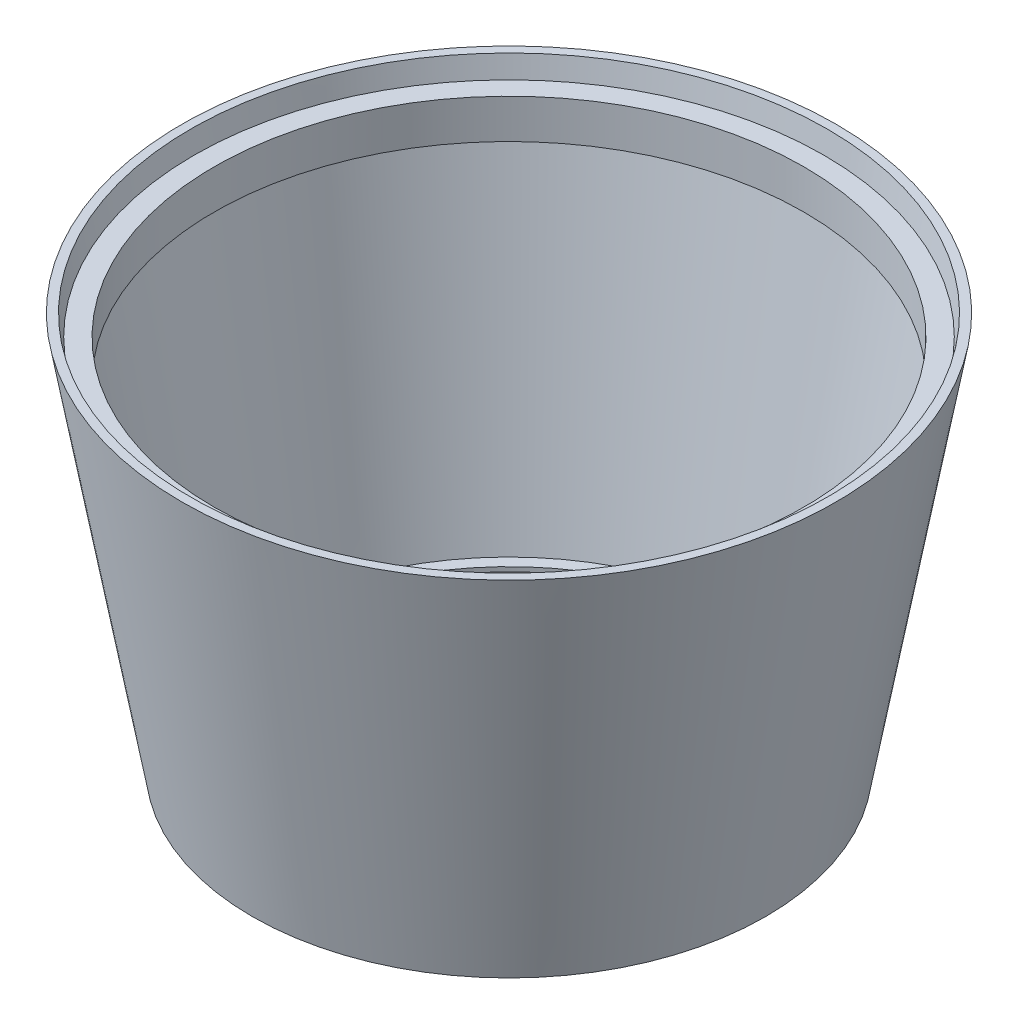
ISO-10303-21;
HEADER;
FILE_DESCRIPTION(('STEP AP214'),'2;1');
FILE_NAME('part.step','',(''),(''),'','','');
FILE_SCHEMA(('AUTOMOTIVE_DESIGN { 1 0 10303 214 1 1 1 1 }'));
ENDSEC;
DATA;
#1=APPLICATION_CONTEXT('core data for automotive mechanical design processes');
#2=APPLICATION_PROTOCOL_DEFINITION('international standard','automotive_design',2000,#1);
#3=PRODUCT_CONTEXT('',#1,'mechanical');
#4=PRODUCT('Part','Part','',(#3));
#5=PRODUCT_RELATED_PRODUCT_CATEGORY('part','',(#4));
#6=PRODUCT_DEFINITION_FORMATION('','',#4);
#7=PRODUCT_DEFINITION_CONTEXT('part definition',#1,'design');
#8=PRODUCT_DEFINITION('design','',#6,#7);
#9=PRODUCT_DEFINITION_SHAPE('','',#8);
#10=(LENGTH_UNIT() NAMED_UNIT(*) SI_UNIT(.MILLI.,.METRE.));
#11=(NAMED_UNIT(*) PLANE_ANGLE_UNIT() SI_UNIT($,.RADIAN.));
#12=(NAMED_UNIT(*) SI_UNIT($,.STERADIAN.) SOLID_ANGLE_UNIT());
#13=UNCERTAINTY_MEASURE_WITH_UNIT(LENGTH_MEASURE(1.E-05),#10,'distance_accuracy_value','');
#14=(GEOMETRIC_REPRESENTATION_CONTEXT(3) GLOBAL_UNCERTAINTY_ASSIGNED_CONTEXT((#13)) GLOBAL_UNIT_ASSIGNED_CONTEXT((#10,
#11,#12)) REPRESENTATION_CONTEXT('',''));
#15=CARTESIAN_POINT('',(0.,0.,0.));
#16=DIRECTION('',(0.,0.,1.));
#17=DIRECTION('',(1.,0.,0.));
#18=AXIS2_PLACEMENT_3D('',#15,#16,#17);
#19=CARTESIAN_POINT('',(-752.,0.,0.));
#20=DIRECTION('',(0.,-1.,0.));
#21=DIRECTION('',(0.,0.,-1.));
#22=AXIS2_PLACEMENT_3D('',#19,#20,#21);
#23=CYLINDRICAL_SURFACE('',#22,752.);
#24=CARTESIAN_POINT('',(-752.,0.,0.));
#25=DIRECTION('',(0.,-1.,0.));
#26=DIRECTION('',(0.,0.,-1.));
#27=AXIS2_PLACEMENT_3D('',#24,#25,#26);
#28=CIRCLE('',#27,752.);
#29=CARTESIAN_POINT('',(-752.,0.,-752.));
#30=VERTEX_POINT('',#29);
#31=EDGE_CURVE('E69',#30,#30,#28,.T.);
#32=ORIENTED_EDGE('',*,*,#31,.T.);
#33=EDGE_LOOP('',(#32));
#34=FACE_BOUND('',#33,.T.);
#35=CARTESIAN_POINT('',(-752.,14.,0.));
#36=DIRECTION('',(0.,-1.,0.));
#37=DIRECTION('',(0.,0.,-1.));
#38=AXIS2_PLACEMENT_3D('',#35,#36,#37);
#39=CIRCLE('',#38,752.);
#40=CARTESIAN_POINT('',(-752.,14.,-752.));
#41=VERTEX_POINT('',#40);
#42=EDGE_CURVE('E10',#41,#41,#39,.T.);
#43=ORIENTED_EDGE('',*,*,#42,.F.);
#44=EDGE_LOOP('',(#43));
#45=FACE_BOUND('',#44,.T.);
#46=ADVANCED_FACE('F35',(#34,#45),#23,.F.);
#47=CARTESIAN_POINT('',(0.,14.,0.));
#48=DIRECTION('',(0.,1.,0.));
#49=DIRECTION('',(0.,0.,1.));
#50=AXIS2_PLACEMENT_3D('',#47,#48,#49);
#51=PLANE('',#50);
#52=ORIENTED_EDGE('',*,*,#42,.T.);
#53=EDGE_LOOP('',(#52));
#54=FACE_BOUND('',#53,.T.);
#55=CARTESIAN_POINT('',(-752.,14.0000000000001,0.));
#56=DIRECTION('',(0.,-1.,0.));
#57=DIRECTION('',(0.,0.,-1.));
#58=AXIS2_PLACEMENT_3D('',#55,#56,#57);
#59=CIRCLE('',#58,788.718983852641);
#60=CARTESIAN_POINT('',(-752.,14.0000000000001,-788.718983852641));
#61=VERTEX_POINT('',#60);
#62=EDGE_CURVE('E41',#61,#61,#59,.T.);
#63=ORIENTED_EDGE('',*,*,#62,.F.);
#64=EDGE_LOOP('',(#63));
#65=FACE_BOUND('',#64,.T.);
#66=ADVANCED_FACE('F87',(#54,#65),#51,.T.);
#67=CARTESIAN_POINT('',(-752.,1044.49266555275,0.));
#68=DIRECTION('',(0.,1.,0.));
#69=DIRECTION('',(0.,0.,1.));
#70=AXIS2_PLACEMENT_3D('',#67,#68,#69);
#71=CONICAL_SURFACE('',#70,972.729405102118,0.176703094880363);
#72=ORIENTED_EDGE('',*,*,#62,.T.);
#73=EDGE_LOOP('',(#72));
#74=FACE_BOUND('',#73,.T.);
#75=CARTESIAN_POINT('',(-752.,1044.49266555275,0.));
#76=DIRECTION('',(0.,-1.,0.));
#77=DIRECTION('',(0.,0.,-1.));
#78=AXIS2_PLACEMENT_3D('',#75,#76,#77);
#79=CIRCLE('',#78,972.729405102118);
#80=CARTESIAN_POINT('',(-752.,1044.49266555275,-972.729405102118));
#81=VERTEX_POINT('',#80);
#82=EDGE_CURVE('E45',#81,#81,#79,.T.);
#83=ORIENTED_EDGE('',*,*,#82,.F.);
#84=EDGE_LOOP('',(#83));
#85=FACE_BOUND('',#84,.T.);
#86=ADVANCED_FACE('F91',(#74,#85),#71,.F.);
#87=CARTESIAN_POINT('',(169.04405635691,1044.49266555275,0.));
#88=DIRECTION('',(0.,-1.,0.));
#89=DIRECTION('',(0.,0.,-1.));
#90=AXIS2_PLACEMENT_3D('',#87,#88,#89);
#91=PLANE('',#90);
#92=ORIENTED_EDGE('',*,*,#82,.T.);
#93=EDGE_LOOP('',(#92));
#94=FACE_BOUND('',#93,.T.);
#95=CARTESIAN_POINT('',(-752.,1044.49266555275,0.));
#96=DIRECTION('',(0.,-1.,0.));
#97=DIRECTION('',(0.,0.,-1.));
#98=AXIS2_PLACEMENT_3D('',#95,#96,#97);
#99=CIRCLE('',#98,921.04405635691);
#100=CARTESIAN_POINT('',(-752.,1044.49266555275,-921.04405635691));
#101=VERTEX_POINT('',#100);
#102=EDGE_CURVE('E49',#101,#101,#99,.T.);
#103=ORIENTED_EDGE('',*,*,#102,.F.);
#104=EDGE_LOOP('',(#103));
#105=FACE_BOUND('',#104,.T.);
#106=ADVANCED_FACE('F95',(#94,#105),#91,.T.);
#107=CARTESIAN_POINT('',(-752.,0.,0.));
#108=DIRECTION('',(0.,-1.,0.));
#109=DIRECTION('',(0.,0.,-1.));
#110=AXIS2_PLACEMENT_3D('',#107,#108,#109);
#111=CYLINDRICAL_SURFACE('',#110,921.04405635691);
#112=ORIENTED_EDGE('',*,*,#102,.T.);
#113=EDGE_LOOP('',(#112));
#114=FACE_BOUND('',#113,.T.);
#115=CARTESIAN_POINT('',(-752.,1167.02375388334,0.));
#116=DIRECTION('',(0.,-1.,0.));
#117=DIRECTION('',(0.,0.,-1.));
#118=AXIS2_PLACEMENT_3D('',#115,#116,#117);
#119=CIRCLE('',#118,921.04405635691);
#120=CARTESIAN_POINT('',(-752.,1167.02375388334,-921.04405635691));
#121=VERTEX_POINT('',#120);
#122=EDGE_CURVE('E54',#121,#121,#119,.T.);
#123=ORIENTED_EDGE('',*,*,#122,.F.);
#124=EDGE_LOOP('',(#123));
#125=FACE_BOUND('',#124,.T.);
#126=ADVANCED_FACE('F101',(#114,#125),#111,.F.);
#127=CARTESIAN_POINT('',(231.609907229416,1167.02375388334,0.));
#128=DIRECTION('',(0.,1.,0.));
#129=DIRECTION('',(0.,0.,1.));
#130=AXIS2_PLACEMENT_3D('',#127,#128,#129);
#131=PLANE('',#130);
#132=ORIENTED_EDGE('',*,*,#122,.T.);
#133=EDGE_LOOP('',(#132));
#134=FACE_BOUND('',#133,.T.);
#135=CARTESIAN_POINT('',(-752.,1167.02375388334,0.));
#136=DIRECTION('',(0.,-1.,0.));
#137=DIRECTION('',(0.,0.,-1.));
#138=AXIS2_PLACEMENT_3D('',#135,#136,#137);
#139=CIRCLE('',#138,983.609907229416);
#140=CARTESIAN_POINT('',(-752.,1167.02375388334,-983.609907229416));
#141=VERTEX_POINT('',#140);
#142=EDGE_CURVE('E57',#141,#141,#139,.T.);
#143=ORIENTED_EDGE('',*,*,#142,.F.);
#144=EDGE_LOOP('',(#143));
#145=FACE_BOUND('',#144,.T.);
#146=ADVANCED_FACE('F105',(#134,#145),#131,.T.);
#147=CARTESIAN_POINT('',(-752.,1231.60455903925,0.));
#148=DIRECTION('',(0.,1.,0.));
#149=DIRECTION('',(0.,0.,1.));
#150=AXIS2_PLACEMENT_3D('',#147,#148,#149);
#151=CONICAL_SURFACE('',#150,995.141809938298,0.176703094880363);
#152=ORIENTED_EDGE('',*,*,#142,.T.);
#153=EDGE_LOOP('',(#152));
#154=FACE_BOUND('',#153,.T.);
#155=CARTESIAN_POINT('',(-752.,1231.60455903925,0.));
#156=DIRECTION('',(0.,-1.,0.));
#157=DIRECTION('',(0.,0.,-1.));
#158=AXIS2_PLACEMENT_3D('',#155,#156,#157);
#159=CIRCLE('',#158,995.141809938298);
#160=CARTESIAN_POINT('',(-752.,1231.60455903925,-995.141809938298));
#161=VERTEX_POINT('',#160);
#162=EDGE_CURVE('E60',#161,#161,#159,.T.);
#163=ORIENTED_EDGE('',*,*,#162,.F.);
#164=EDGE_LOOP('',(#163));
#165=FACE_BOUND('',#164,.T.);
#166=ADVANCED_FACE('F109',(#154,#165),#151,.F.);
#167=CARTESIAN_POINT('',(269.922063782985,1231.60455903925,0.));
#168=DIRECTION('',(0.,1.,0.));
#169=DIRECTION('',(0.,0.,1.));
#170=AXIS2_PLACEMENT_3D('',#167,#168,#169);
#171=PLANE('',#170);
#172=ORIENTED_EDGE('',*,*,#162,.T.);
#173=EDGE_LOOP('',(#172));
#174=FACE_BOUND('',#173,.T.);
#175=CARTESIAN_POINT('',(-752.,1231.60455903925,0.));
#176=DIRECTION('',(0.,-1.,0.));
#177=DIRECTION('',(0.,0.,-1.));
#178=AXIS2_PLACEMENT_3D('',#175,#176,#177);
#179=CIRCLE('',#178,1021.92206378299);
#180=CARTESIAN_POINT('',(-752.,1231.60455903925,-1021.92206378299));
#181=VERTEX_POINT('',#180);
#182=EDGE_CURVE('E63',#181,#181,#179,.T.);
#183=ORIENTED_EDGE('',*,*,#182,.F.);
#184=EDGE_LOOP('',(#183));
#185=FACE_BOUND('',#184,.T.);
#186=ADVANCED_FACE('F83',(#174,#185),#171,.T.);
#187=CARTESIAN_POINT('',(-752.,0.,0.));
#188=DIRECTION('',(0.,1.,0.));
#189=DIRECTION('',(0.,0.,1.));
#190=AXIS2_PLACEMENT_3D('',#187,#188,#189);
#191=CONICAL_SURFACE('',#190,802.,0.176703094880364);
#192=ORIENTED_EDGE('',*,*,#182,.T.);
#193=EDGE_LOOP('',(#192));
#194=FACE_BOUND('',#193,.T.);
#195=CARTESIAN_POINT('',(-752.,0.,0.));
#196=DIRECTION('',(0.,-1.,0.));
#197=DIRECTION('',(0.,0.,-1.));
#198=AXIS2_PLACEMENT_3D('',#195,#196,#197);
#199=CIRCLE('',#198,802.);
#200=CARTESIAN_POINT('',(-752.,0.,-802.));
#201=VERTEX_POINT('',#200);
#202=EDGE_CURVE('E66',#201,#201,#199,.T.);
#203=ORIENTED_EDGE('',*,*,#202,.F.);
#204=EDGE_LOOP('',(#203));
#205=FACE_BOUND('',#204,.T.);
#206=ADVANCED_FACE('F77',(#194,#205),#191,.T.);
#207=CARTESIAN_POINT('',(0.,0.,0.));
#208=DIRECTION('',(0.,-1.,0.));
#209=DIRECTION('',(0.,0.,-1.));
#210=AXIS2_PLACEMENT_3D('',#207,#208,#209);
#211=PLANE('',#210);
#212=ORIENTED_EDGE('',*,*,#202,.T.);
#213=EDGE_LOOP('',(#212));
#214=FACE_BOUND('',#213,.T.);
#215=ORIENTED_EDGE('',*,*,#31,.F.);
#216=EDGE_LOOP('',(#215));
#217=FACE_BOUND('',#216,.T.);
#218=ADVANCED_FACE('F75',(#214,#217),#211,.T.);
#219=CLOSED_SHELL('',(#46,#66,#86,#106,#126,#146,#166,#186,#206,#218));
#220=MANIFOLD_SOLID_BREP('B2',#219);
#221=ADVANCED_BREP_SHAPE_REPRESENTATION('',(#18,#220),#14);
#222=SHAPE_DEFINITION_REPRESENTATION(#9,#221);
ENDSEC;
END-ISO-10303-21;
